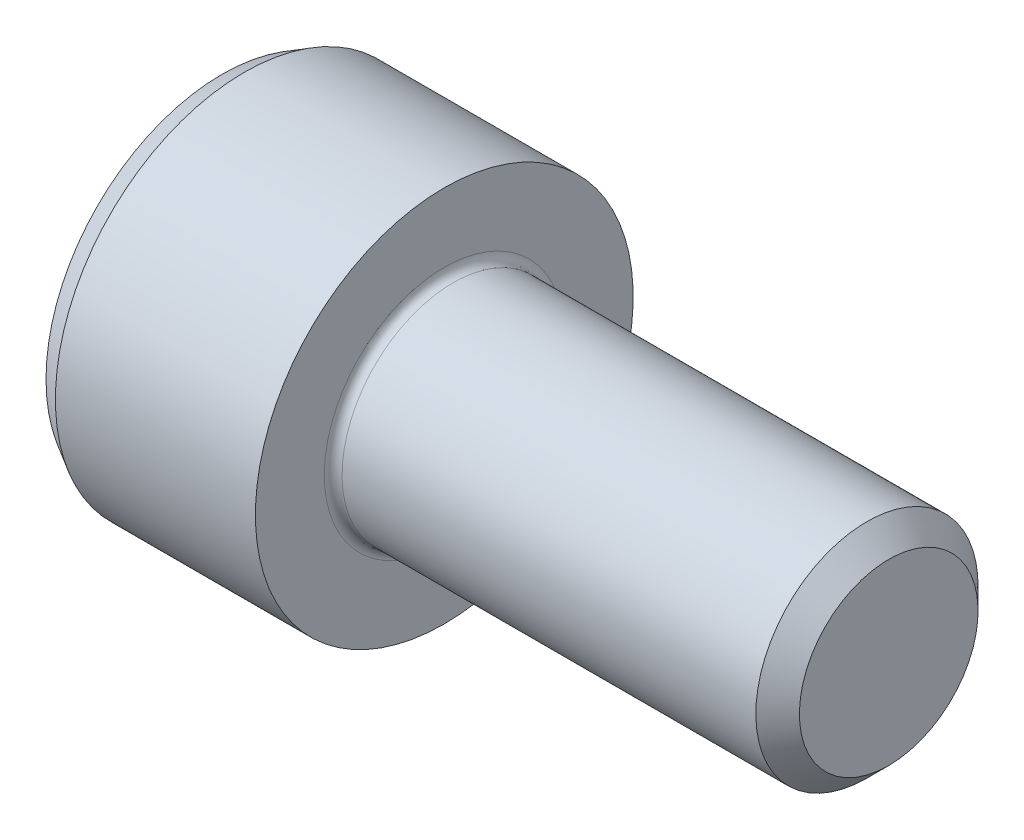
ISO-10303-21;
HEADER;
FILE_DESCRIPTION(('STEP AP214'),'2;1');
FILE_NAME('part.step','',(''),(''),'','','');
FILE_SCHEMA(('AUTOMOTIVE_DESIGN { 1 0 10303 214 1 1 1 1 }'));
ENDSEC;
DATA;
#1=APPLICATION_CONTEXT('core data for automotive mechanical design processes');
#2=APPLICATION_PROTOCOL_DEFINITION('international standard','automotive_design',2000,#1);
#3=PRODUCT_CONTEXT('',#1,'mechanical');
#4=PRODUCT('Part','Part','',(#3));
#5=PRODUCT_RELATED_PRODUCT_CATEGORY('part','',(#4));
#6=PRODUCT_DEFINITION_FORMATION('','',#4);
#7=PRODUCT_DEFINITION_CONTEXT('part definition',#1,'design');
#8=PRODUCT_DEFINITION('design','',#6,#7);
#9=PRODUCT_DEFINITION_SHAPE('','',#8);
#10=(LENGTH_UNIT() NAMED_UNIT(*) SI_UNIT(.MILLI.,.METRE.));
#11=(NAMED_UNIT(*) PLANE_ANGLE_UNIT() SI_UNIT($,.RADIAN.));
#12=(NAMED_UNIT(*) SI_UNIT($,.STERADIAN.) SOLID_ANGLE_UNIT());
#13=UNCERTAINTY_MEASURE_WITH_UNIT(LENGTH_MEASURE(1.E-05),#10,'distance_accuracy_value','');
#14=(GEOMETRIC_REPRESENTATION_CONTEXT(3) GLOBAL_UNCERTAINTY_ASSIGNED_CONTEXT((#13)) GLOBAL_UNIT_ASSIGNED_CONTEXT((#10,
#11,#12)) REPRESENTATION_CONTEXT('',''));
#15=CARTESIAN_POINT('',(0.,0.,0.));
#16=DIRECTION('',(0.,0.,1.));
#17=DIRECTION('',(1.,0.,0.));
#18=AXIS2_PLACEMENT_3D('',#15,#16,#17);
#19=CARTESIAN_POINT('',(-5.,0.,0.));
#20=DIRECTION('',(1.,0.,0.));
#21=DIRECTION('',(0.,1.,0.));
#22=AXIS2_PLACEMENT_3D('',#19,#20,#21);
#23=PLANE('',#22);
#24=CARTESIAN_POINT('',(-5.,0.,0.));
#25=DIRECTION('',(-1.,0.,0.));
#26=DIRECTION('',(0.,-1.,0.));
#27=AXIS2_PLACEMENT_3D('',#24,#25,#26);
#28=CIRCLE('',#27,3.96132486540519);
#29=CARTESIAN_POINT('',(-5.,-3.96132486540519,0.));
#30=VERTEX_POINT('',#29);
#31=EDGE_CURVE('E145',#30,#30,#28,.T.);
#32=ORIENTED_EDGE('',*,*,#31,.T.);
#33=EDGE_LOOP('',(#32));
#34=FACE_BOUND('',#33,.T.);
#35=DIRECTION('',(0.,0.499999999999983,-0.866025403784448));
#36=VECTOR('',#35,1.);
#37=CARTESIAN_POINT('',(-5.,-2.3094010767585,0.));
#38=LINE('',#37,#36);
#39=CARTESIAN_POINT('',(-5.,-2.3094010767585,0.));
#40=VERTEX_POINT('',#39);
#41=CARTESIAN_POINT('',(-5.,-1.1547005383793,-2.));
#42=VERTEX_POINT('',#41);
#43=EDGE_CURVE('E387',#40,#42,#38,.T.);
#44=ORIENTED_EDGE('',*,*,#43,.T.);
#45=DIRECTION('',(0.,1.,0.));
#46=VECTOR('',#45,1.);
#47=CARTESIAN_POINT('',(-5.,-1.1547005383793,-2.));
#48=LINE('',#47,#46);
#49=CARTESIAN_POINT('',(-5.,1.1547005383793,-2.));
#50=VERTEX_POINT('',#49);
#51=EDGE_CURVE('E389',#42,#50,#48,.T.);
#52=ORIENTED_EDGE('',*,*,#51,.T.);
#53=DIRECTION('',(0.,0.499999999999983,0.866025403784448));
#54=VECTOR('',#53,1.);
#55=CARTESIAN_POINT('',(-5.,1.1547005383793,-2.));
#56=LINE('',#55,#54);
#57=CARTESIAN_POINT('',(-5.,2.3094010767585,0.));
#58=VERTEX_POINT('',#57);
#59=EDGE_CURVE('E391',#50,#58,#56,.T.);
#60=ORIENTED_EDGE('',*,*,#59,.T.);
#61=DIRECTION('',(0.,-0.499999999999983,0.866025403784448));
#62=VECTOR('',#61,1.);
#63=CARTESIAN_POINT('',(-5.,2.3094010767585,0.));
#64=LINE('',#63,#62);
#65=CARTESIAN_POINT('',(-5.,1.1547005383793,2.));
#66=VERTEX_POINT('',#65);
#67=EDGE_CURVE('E119',#58,#66,#64,.T.);
#68=ORIENTED_EDGE('',*,*,#67,.T.);
#69=DIRECTION('',(0.,-1.,0.));
#70=VECTOR('',#69,1.);
#71=CARTESIAN_POINT('',(-5.,1.1547005383793,2.));
#72=LINE('',#71,#70);
#73=CARTESIAN_POINT('',(-5.,-1.1547005383793,2.));
#74=VERTEX_POINT('',#73);
#75=EDGE_CURVE('E384',#66,#74,#72,.T.);
#76=ORIENTED_EDGE('',*,*,#75,.T.);
#77=DIRECTION('',(0.,-0.499999999999983,-0.866025403784448));
#78=VECTOR('',#77,1.);
#79=CARTESIAN_POINT('',(-5.,-1.1547005383793,2.));
#80=LINE('',#79,#78);
#81=EDGE_CURVE('E134',#74,#40,#80,.T.);
#82=ORIENTED_EDGE('',*,*,#81,.T.);
#83=EDGE_LOOP('',(#44,#52,#60,#68,#76,#82));
#84=FACE_BOUND('',#83,.T.);
#85=ADVANCED_FACE('F35',(#34,#84),#23,.F.);
#86=CARTESIAN_POINT('',(10.,2.0095,0.));
#87=DIRECTION('',(-1.,0.,0.));
#88=DIRECTION('',(0.,-1.,0.));
#89=AXIS2_PLACEMENT_3D('',#86,#87,#88);
#90=PLANE('',#89);
#91=CARTESIAN_POINT('',(10.,0.,0.));
#92=DIRECTION('',(-1.,0.,0.));
#93=DIRECTION('',(0.,-1.,0.));
#94=AXIS2_PLACEMENT_3D('',#91,#92,#93);
#95=CIRCLE('',#94,2.0095);
#96=CARTESIAN_POINT('',(10.,-2.0095,0.));
#97=VERTEX_POINT('',#96);
#98=EDGE_CURVE('E11',#97,#97,#95,.T.);
#99=ORIENTED_EDGE('',*,*,#98,.F.);
#100=EDGE_LOOP('',(#99));
#101=FACE_BOUND('',#100,.T.);
#102=ADVANCED_FACE('F37',(#101),#90,.F.);
#103=CARTESIAN_POINT('',(10.,0.,0.));
#104=DIRECTION('',(-1.,0.,0.));
#105=DIRECTION('',(0.,-1.,0.));
#106=AXIS2_PLACEMENT_3D('',#103,#104,#105);
#107=CONICAL_SURFACE('',#106,2.0095,0.785398163397448);
#108=CARTESIAN_POINT('',(9.5095,0.,0.));
#109=DIRECTION('',(-1.,0.,0.));
#110=DIRECTION('',(0.,-1.,0.));
#111=AXIS2_PLACEMENT_3D('',#108,#109,#110);
#112=CIRCLE('',#111,2.5);
#113=CARTESIAN_POINT('',(9.5095,-2.5,0.));
#114=VERTEX_POINT('',#113);
#115=EDGE_CURVE('E43',#114,#114,#112,.T.);
#116=ORIENTED_EDGE('',*,*,#115,.F.);
#117=EDGE_LOOP('',(#116));
#118=FACE_BOUND('',#117,.T.);
#119=ORIENTED_EDGE('',*,*,#98,.T.);
#120=EDGE_LOOP('',(#119));
#121=FACE_BOUND('',#120,.T.);
#122=ADVANCED_FACE('F165',(#118,#121),#107,.T.);
#123=CARTESIAN_POINT('',(10.,0.,0.));
#124=DIRECTION('',(-1.,0.,0.));
#125=DIRECTION('',(0.,-1.,0.));
#126=AXIS2_PLACEMENT_3D('',#123,#124,#125);
#127=CYLINDRICAL_SURFACE('',#126,2.5);
#128=CARTESIAN_POINT('',(0.199999999999988,0.,0.));
#129=DIRECTION('',(-1.,0.,0.));
#130=DIRECTION('',(0.,-1.,0.));
#131=AXIS2_PLACEMENT_3D('',#128,#129,#130);
#132=CIRCLE('',#131,2.5);
#133=CARTESIAN_POINT('',(0.199999999999987,-2.49999999999999,0.));
#134=VERTEX_POINT('',#133);
#135=EDGE_CURVE('E158',#134,#134,#132,.T.);
#136=ORIENTED_EDGE('',*,*,#135,.F.);
#137=EDGE_LOOP('',(#136));
#138=FACE_BOUND('',#137,.T.);
#139=ORIENTED_EDGE('',*,*,#115,.T.);
#140=EDGE_LOOP('',(#139));
#141=FACE_BOUND('',#140,.T.);
#142=ADVANCED_FACE('F163',(#138,#141),#127,.T.);
#143=CARTESIAN_POINT('',(0.200000000000014,0.,0.));
#144=DIRECTION('',(-1.,0.,0.));
#145=DIRECTION('',(0.,-1.,0.));
#146=AXIS2_PLACEMENT_3D('',#143,#144,#145);
#147=TOROIDAL_SURFACE('',#146,2.70000000000001,0.200000000000015);
#148=CARTESIAN_POINT('',(0.,0.,0.));
#149=DIRECTION('',(-1.,0.,0.));
#150=DIRECTION('',(0.,-1.,0.));
#151=AXIS2_PLACEMENT_3D('',#148,#149,#150);
#152=CIRCLE('',#151,2.7);
#153=CARTESIAN_POINT('',(0.,-2.69999999999999,0.));
#154=VERTEX_POINT('',#153);
#155=EDGE_CURVE('E155',#154,#154,#152,.T.);
#156=ORIENTED_EDGE('',*,*,#155,.F.);
#157=EDGE_LOOP('',(#156));
#158=FACE_BOUND('',#157,.T.);
#159=ORIENTED_EDGE('',*,*,#135,.T.);
#160=EDGE_LOOP('',(#159));
#161=FACE_BOUND('',#160,.T.);
#162=ADVANCED_FACE('F194',(#158,#161),#147,.F.);
#163=CARTESIAN_POINT('',(0.,4.25,0.));
#164=DIRECTION('',(-1.,0.,0.));
#165=DIRECTION('',(0.,-1.,0.));
#166=AXIS2_PLACEMENT_3D('',#163,#164,#165);
#167=PLANE('',#166);
#168=CARTESIAN_POINT('',(0.,0.,0.));
#169=DIRECTION('',(-1.,0.,0.));
#170=DIRECTION('',(0.,-1.,0.));
#171=AXIS2_PLACEMENT_3D('',#168,#169,#170);
#172=CIRCLE('',#171,4.25);
#173=CARTESIAN_POINT('',(0.,-4.24999999999999,0.));
#174=VERTEX_POINT('',#173);
#175=EDGE_CURVE('E152',#174,#174,#172,.T.);
#176=ORIENTED_EDGE('',*,*,#175,.F.);
#177=EDGE_LOOP('',(#176));
#178=FACE_BOUND('',#177,.T.);
#179=ORIENTED_EDGE('',*,*,#155,.T.);
#180=EDGE_LOOP('',(#179));
#181=FACE_BOUND('',#180,.T.);
#182=ADVANCED_FACE('F190',(#178,#181),#167,.F.);
#183=CARTESIAN_POINT('',(10.,0.,0.));
#184=DIRECTION('',(-1.,0.,0.));
#185=DIRECTION('',(0.,-1.,0.));
#186=AXIS2_PLACEMENT_3D('',#183,#184,#185);
#187=CYLINDRICAL_SURFACE('',#186,4.24999999999999);
#188=CARTESIAN_POINT('',(-4.5,0.,0.));
#189=DIRECTION('',(-1.,0.,0.));
#190=DIRECTION('',(0.,-1.,0.));
#191=AXIS2_PLACEMENT_3D('',#188,#189,#190);
#192=CIRCLE('',#191,4.24999999999999);
#193=CARTESIAN_POINT('',(-4.5,-4.24999999999999,0.));
#194=VERTEX_POINT('',#193);
#195=EDGE_CURVE('E149',#194,#194,#192,.T.);
#196=ORIENTED_EDGE('',*,*,#195,.F.);
#197=EDGE_LOOP('',(#196));
#198=FACE_BOUND('',#197,.T.);
#199=ORIENTED_EDGE('',*,*,#175,.T.);
#200=EDGE_LOOP('',(#199));
#201=FACE_BOUND('',#200,.T.);
#202=ADVANCED_FACE('F186',(#198,#201),#187,.T.);
#203=CARTESIAN_POINT('',(-4.5,0.,0.));
#204=DIRECTION('',(1.,0.,0.));
#205=DIRECTION('',(0.,1.,0.));
#206=AXIS2_PLACEMENT_3D('',#203,#204,#205);
#207=CONICAL_SURFACE('',#206,4.24999999999999,0.523598775598279);
#208=ORIENTED_EDGE('',*,*,#31,.F.);
#209=EDGE_LOOP('',(#208));
#210=FACE_BOUND('',#209,.T.);
#211=ORIENTED_EDGE('',*,*,#195,.T.);
#212=EDGE_LOOP('',(#211));
#213=FACE_BOUND('',#212,.T.);
#214=ADVANCED_FACE('F183',(#210,#213),#207,.T.);
#215=CARTESIAN_POINT('',(-2.5,1.1547005383793,2.));
#216=DIRECTION('',(0.,0.,-1.));
#217=DIRECTION('',(-1.,0.,0.));
#218=AXIS2_PLACEMENT_3D('',#215,#216,#217);
#219=PLANE('',#218);
#220=DIRECTION('',(0.,-1.,0.));
#221=VECTOR('',#220,1.);
#222=CARTESIAN_POINT('',(-2.5,1.1547005383793,2.));
#223=LINE('',#222,#221);
#224=CARTESIAN_POINT('',(-2.5,1.1547005383793,2.));
#225=VERTEX_POINT('',#224);
#226=CARTESIAN_POINT('',(-2.5,0.,2.));
#227=VERTEX_POINT('',#226);
#228=EDGE_CURVE('E116',#225,#227,#223,.T.);
#229=ORIENTED_EDGE('',*,*,#228,.T.);
#230=CARTESIAN_POINT('',(-2.5,-1.1547005383793,2.));
#231=VERTEX_POINT('',#230);
#232=EDGE_CURVE('E108',#227,#231,#223,.T.);
#233=ORIENTED_EDGE('',*,*,#232,.T.);
#234=DIRECTION('',(-1.,0.,0.));
#235=VECTOR('',#234,1.);
#236=CARTESIAN_POINT('',(-2.5,-1.1547005383793,2.));
#237=LINE('',#236,#235);
#238=EDGE_CURVE('E113',#231,#74,#237,.T.);
#239=ORIENTED_EDGE('',*,*,#238,.T.);
#240=ORIENTED_EDGE('',*,*,#75,.F.);
#241=DIRECTION('',(-1.,0.,0.));
#242=VECTOR('',#241,1.);
#243=CARTESIAN_POINT('',(-2.5,1.1547005383793,2.));
#244=LINE('',#243,#242);
#245=EDGE_CURVE('E379',#225,#66,#244,.T.);
#246=ORIENTED_EDGE('',*,*,#245,.F.);
#247=EDGE_LOOP('',(#229,#233,#239,#240,#246));
#248=FACE_BOUND('',#247,.T.);
#249=ADVANCED_FACE('F110',(#248),#219,.T.);
#250=CARTESIAN_POINT('',(-2.5,-1.1547005383793,2.));
#251=DIRECTION('',(0.,0.866025403784448,-0.499999999999983));
#252=DIRECTION('',(0.,0.499999999999983,0.866025403784448));
#253=AXIS2_PLACEMENT_3D('',#250,#251,#252);
#254=PLANE('',#253);
#255=DIRECTION('',(0.,-0.499999999999983,-0.866025403784448));
#256=VECTOR('',#255,1.);
#257=CARTESIAN_POINT('',(-2.5,-1.1547005383793,2.));
#258=LINE('',#257,#256);
#259=CARTESIAN_POINT('',(-2.5,-1.73205080756891,0.999999999999976));
#260=VERTEX_POINT('',#259);
#261=EDGE_CURVE('E122',#231,#260,#258,.T.);
#262=ORIENTED_EDGE('',*,*,#261,.T.);
#263=CARTESIAN_POINT('',(-2.5,-2.3094010767585,0.));
#264=VERTEX_POINT('',#263);
#265=EDGE_CURVE('E129',#260,#264,#258,.T.);
#266=ORIENTED_EDGE('',*,*,#265,.T.);
#267=DIRECTION('',(-1.,0.,0.));
#268=VECTOR('',#267,1.);
#269=CARTESIAN_POINT('',(-2.5,-2.3094010767585,0.));
#270=LINE('',#269,#268);
#271=EDGE_CURVE('E135',#264,#40,#270,.T.);
#272=ORIENTED_EDGE('',*,*,#271,.T.);
#273=ORIENTED_EDGE('',*,*,#81,.F.);
#274=ORIENTED_EDGE('',*,*,#238,.F.);
#275=EDGE_LOOP('',(#262,#266,#272,#273,#274));
#276=FACE_BOUND('',#275,.T.);
#277=ADVANCED_FACE('F132',(#276),#254,.T.);
#278=CARTESIAN_POINT('',(-2.5,-2.3094010767585,0.));
#279=DIRECTION('',(0.,0.866025403784448,0.499999999999983));
#280=DIRECTION('',(0.,-0.499999999999983,0.866025403784448));
#281=AXIS2_PLACEMENT_3D('',#278,#279,#280);
#282=PLANE('',#281);
#283=DIRECTION('',(0.,0.499999999999983,-0.866025403784448));
#284=VECTOR('',#283,1.);
#285=CARTESIAN_POINT('',(-2.5,-2.3094010767585,0.));
#286=LINE('',#285,#284);
#287=CARTESIAN_POINT('',(-2.5,-1.7320508075689,-0.999999999999967));
#288=VERTEX_POINT('',#287);
#289=EDGE_CURVE('E50',#264,#288,#286,.T.);
#290=ORIENTED_EDGE('',*,*,#289,.T.);
#291=CARTESIAN_POINT('',(-2.5,-1.1547005383793,-2.));
#292=VERTEX_POINT('',#291);
#293=EDGE_CURVE('E128',#288,#292,#286,.T.);
#294=ORIENTED_EDGE('',*,*,#293,.T.);
#295=DIRECTION('',(-1.,0.,0.));
#296=VECTOR('',#295,1.);
#297=CARTESIAN_POINT('',(-2.5,-1.1547005383793,-2.));
#298=LINE('',#297,#296);
#299=EDGE_CURVE('E140',#292,#42,#298,.T.);
#300=ORIENTED_EDGE('',*,*,#299,.T.);
#301=ORIENTED_EDGE('',*,*,#43,.F.);
#302=ORIENTED_EDGE('',*,*,#271,.F.);
#303=EDGE_LOOP('',(#290,#294,#300,#301,#302));
#304=FACE_BOUND('',#303,.T.);
#305=ADVANCED_FACE('F234',(#304),#282,.T.);
#306=CARTESIAN_POINT('',(-2.5,-1.1547005383793,-2.));
#307=DIRECTION('',(0.,0.,1.));
#308=DIRECTION('',(1.,0.,0.));
#309=AXIS2_PLACEMENT_3D('',#306,#307,#308);
#310=PLANE('',#309);
#311=DIRECTION('',(0.,1.,0.));
#312=VECTOR('',#311,1.);
#313=CARTESIAN_POINT('',(-2.5,-1.1547005383793,-2.));
#314=LINE('',#313,#312);
#315=CARTESIAN_POINT('',(-2.5,0.,-2.));
#316=VERTEX_POINT('',#315);
#317=EDGE_CURVE('E409',#292,#316,#314,.T.);
#318=ORIENTED_EDGE('',*,*,#317,.T.);
#319=CARTESIAN_POINT('',(-2.5,1.1547005383793,-2.));
#320=VERTEX_POINT('',#319);
#321=EDGE_CURVE('E407',#316,#320,#314,.T.);
#322=ORIENTED_EDGE('',*,*,#321,.T.);
#323=DIRECTION('',(-1.,0.,0.));
#324=VECTOR('',#323,1.);
#325=CARTESIAN_POINT('',(-2.5,1.1547005383793,-2.));
#326=LINE('',#325,#324);
#327=EDGE_CURVE('E395',#320,#50,#326,.T.);
#328=ORIENTED_EDGE('',*,*,#327,.T.);
#329=ORIENTED_EDGE('',*,*,#51,.F.);
#330=ORIENTED_EDGE('',*,*,#299,.F.);
#331=EDGE_LOOP('',(#318,#322,#328,#329,#330));
#332=FACE_BOUND('',#331,.T.);
#333=ADVANCED_FACE('F241',(#332),#310,.T.);
#334=CARTESIAN_POINT('',(-2.5,1.1547005383793,-2.));
#335=DIRECTION('',(0.,-0.866025403784448,0.499999999999983));
#336=DIRECTION('',(0.,-0.499999999999983,-0.866025403784448));
#337=AXIS2_PLACEMENT_3D('',#334,#335,#336);
#338=PLANE('',#337);
#339=DIRECTION('',(0.,0.499999999999983,0.866025403784448));
#340=VECTOR('',#339,1.);
#341=CARTESIAN_POINT('',(-2.5,1.1547005383793,-2.));
#342=LINE('',#341,#340);
#343=CARTESIAN_POINT('',(-2.5,1.73205080756891,-0.999999999999976));
#344=VERTEX_POINT('',#343);
#345=EDGE_CURVE('E371',#320,#344,#342,.T.);
#346=ORIENTED_EDGE('',*,*,#345,.T.);
#347=CARTESIAN_POINT('',(-2.5,2.3094010767585,0.));
#348=VERTEX_POINT('',#347);
#349=EDGE_CURVE('E410',#344,#348,#342,.T.);
#350=ORIENTED_EDGE('',*,*,#349,.T.);
#351=DIRECTION('',(-1.,0.,0.));
#352=VECTOR('',#351,1.);
#353=CARTESIAN_POINT('',(-2.5,2.3094010767585,0.));
#354=LINE('',#353,#352);
#355=EDGE_CURVE('E377',#348,#58,#354,.T.);
#356=ORIENTED_EDGE('',*,*,#355,.T.);
#357=ORIENTED_EDGE('',*,*,#59,.F.);
#358=ORIENTED_EDGE('',*,*,#327,.F.);
#359=EDGE_LOOP('',(#346,#350,#356,#357,#358));
#360=FACE_BOUND('',#359,.T.);
#361=ADVANCED_FACE('F248',(#360),#338,.T.);
#362=CARTESIAN_POINT('',(-2.5,2.3094010767585,0.));
#363=DIRECTION('',(0.,-0.866025403784448,-0.499999999999983));
#364=DIRECTION('',(0.,0.499999999999983,-0.866025403784448));
#365=AXIS2_PLACEMENT_3D('',#362,#363,#364);
#366=PLANE('',#365);
#367=DIRECTION('',(0.,-0.499999999999983,0.866025403784448));
#368=VECTOR('',#367,1.);
#369=CARTESIAN_POINT('',(-2.5,2.3094010767585,0.));
#370=LINE('',#369,#368);
#371=CARTESIAN_POINT('',(-2.5,1.73205080756891,0.999999999999976));
#372=VERTEX_POINT('',#371);
#373=EDGE_CURVE('E370',#348,#372,#370,.T.);
#374=ORIENTED_EDGE('',*,*,#373,.T.);
#375=EDGE_CURVE('E367',#372,#225,#370,.T.);
#376=ORIENTED_EDGE('',*,*,#375,.T.);
#377=ORIENTED_EDGE('',*,*,#245,.T.);
#378=ORIENTED_EDGE('',*,*,#67,.F.);
#379=ORIENTED_EDGE('',*,*,#355,.F.);
#380=EDGE_LOOP('',(#374,#376,#377,#378,#379));
#381=FACE_BOUND('',#380,.T.);
#382=ADVANCED_FACE('F256',(#381),#366,.T.);
#383=CARTESIAN_POINT('',(-2.5,0.,0.));
#384=DIRECTION('',(1.,0.,0.));
#385=DIRECTION('',(0.,0.,-1.));
#386=AXIS2_PLACEMENT_3D('',#383,#384,#385);
#387=PLANE('',#386);
#388=CARTESIAN_POINT('',(-2.5,0.,0.));
#389=DIRECTION('',(-1.,0.,0.));
#390=DIRECTION('',(0.,0.,1.));
#391=AXIS2_PLACEMENT_3D('',#388,#389,#390);
#392=CIRCLE('',#391,2.);
#393=EDGE_CURVE('E414',#344,#316,#392,.T.);
#394=ORIENTED_EDGE('',*,*,#393,.F.);
#395=ORIENTED_EDGE('',*,*,#345,.F.);
#396=ORIENTED_EDGE('',*,*,#321,.F.);
#397=EDGE_LOOP('',(#394,#395,#396));
#398=FACE_BOUND('',#397,.T.);
#399=ADVANCED_FACE('F264',(#398),#387,.F.);
#400=EDGE_CURVE('E146',#372,#344,#392,.T.);
#401=ORIENTED_EDGE('',*,*,#400,.F.);
#402=ORIENTED_EDGE('',*,*,#373,.F.);
#403=ORIENTED_EDGE('',*,*,#349,.F.);
#404=EDGE_LOOP('',(#401,#402,#403));
#405=FACE_BOUND('',#404,.T.);
#406=ADVANCED_FACE('F272',(#405),#387,.F.);
#407=EDGE_CURVE('E139',#227,#372,#392,.T.);
#408=ORIENTED_EDGE('',*,*,#407,.F.);
#409=ORIENTED_EDGE('',*,*,#228,.F.);
#410=ORIENTED_EDGE('',*,*,#375,.F.);
#411=EDGE_LOOP('',(#408,#409,#410));
#412=FACE_BOUND('',#411,.T.);
#413=ADVANCED_FACE('F281',(#412),#387,.F.);
#414=EDGE_CURVE('E124',#260,#227,#392,.T.);
#415=ORIENTED_EDGE('',*,*,#414,.F.);
#416=ORIENTED_EDGE('',*,*,#261,.F.);
#417=ORIENTED_EDGE('',*,*,#232,.F.);
#418=EDGE_LOOP('',(#415,#416,#417));
#419=FACE_BOUND('',#418,.T.);
#420=ADVANCED_FACE('F123',(#419),#387,.F.);
#421=EDGE_CURVE('E137',#288,#260,#392,.T.);
#422=ORIENTED_EDGE('',*,*,#421,.F.);
#423=ORIENTED_EDGE('',*,*,#289,.F.);
#424=ORIENTED_EDGE('',*,*,#265,.F.);
#425=EDGE_LOOP('',(#422,#423,#424));
#426=FACE_BOUND('',#425,.T.);
#427=ADVANCED_FACE('F294',(#426),#387,.F.);
#428=EDGE_CURVE('E415',#316,#288,#392,.T.);
#429=ORIENTED_EDGE('',*,*,#428,.F.);
#430=ORIENTED_EDGE('',*,*,#317,.F.);
#431=ORIENTED_EDGE('',*,*,#293,.F.);
#432=EDGE_LOOP('',(#429,#430,#431));
#433=FACE_BOUND('',#432,.T.);
#434=ADVANCED_FACE('F275',(#433),#387,.F.);
#435=CARTESIAN_POINT('',(-1.3452994616207,0.,0.));
#436=DIRECTION('',(-1.,0.,0.));
#437=DIRECTION('',(0.,0.,1.));
#438=AXIS2_PLACEMENT_3D('',#435,#436,#437);
#439=CONICAL_SURFACE('',#438,0.,1.04719755119658);
#440=ORIENTED_EDGE('',*,*,#407,.T.);
#441=ORIENTED_EDGE('',*,*,#400,.T.);
#442=ORIENTED_EDGE('',*,*,#393,.T.);
#443=ORIENTED_EDGE('',*,*,#428,.T.);
#444=ORIENTED_EDGE('',*,*,#421,.T.);
#445=ORIENTED_EDGE('',*,*,#414,.T.);
#446=EDGE_LOOP('',(#440,#441,#442,#443,#444,#445));
#447=FACE_BOUND('',#446,.T.);
#448=CARTESIAN_POINT('',(-1.3452994616207,0.,0.));
#449=VERTEX_POINT('',#448);
#450=VERTEX_LOOP('',#449);
#451=FACE_BOUND('',#450,.T.);
#452=ADVANCED_FACE('F181',(#447,#451),#439,.F.);
#453=CLOSED_SHELL('',(#85,#102,#122,#142,#162,#182,#202,#214,#249,#277,#305,#333,#361,#382,#399,
#406,#413,#420,#427,#434,#452));
#454=MANIFOLD_SOLID_BREP('B2',#453);
#455=ADVANCED_BREP_SHAPE_REPRESENTATION('',(#18,#454),#14);
#456=SHAPE_DEFINITION_REPRESENTATION(#9,#455);
ENDSEC;
END-ISO-10303-21;
